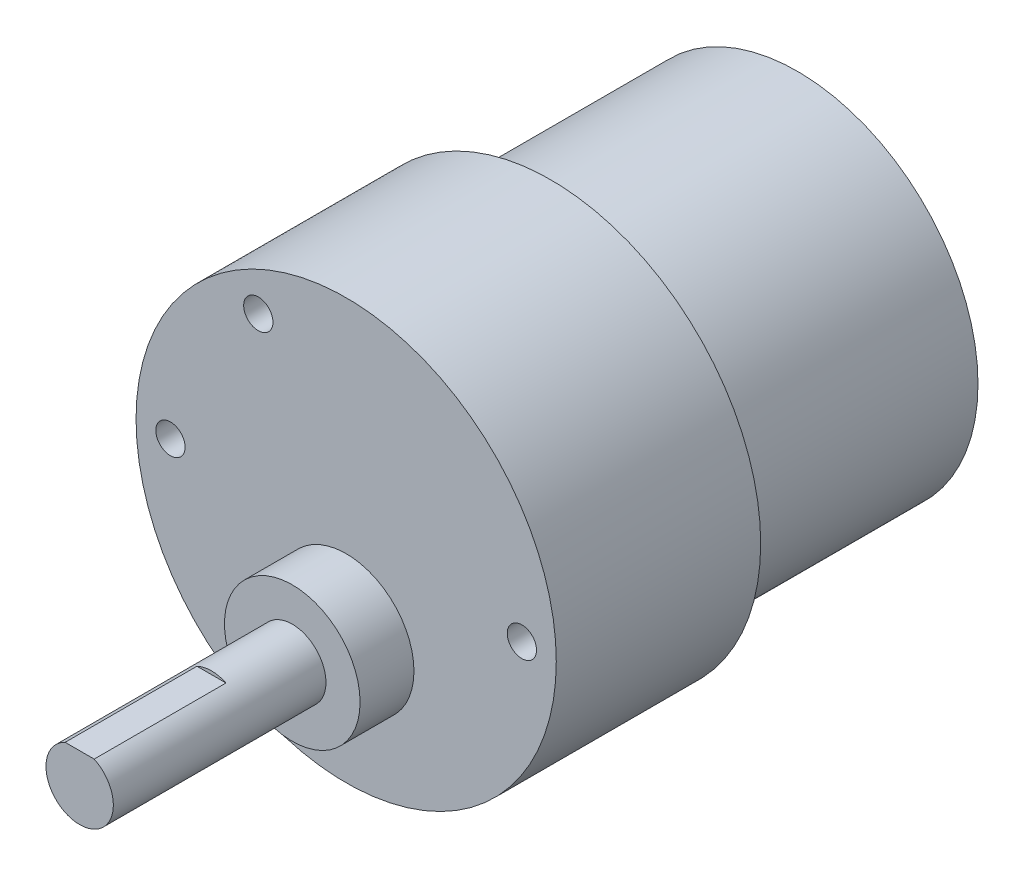
ISO-10303-21;
HEADER;
FILE_DESCRIPTION(('STEP AP214'),'2;1');
FILE_NAME('part.step','',(''),(''),'','','');
FILE_SCHEMA(('AUTOMOTIVE_DESIGN { 1 0 10303 214 1 1 1 1 }'));
ENDSEC;
DATA;
#1=APPLICATION_CONTEXT('core data for automotive mechanical design processes');
#2=APPLICATION_PROTOCOL_DEFINITION('international standard','automotive_design',2000,#1);
#3=PRODUCT_CONTEXT('',#1,'mechanical');
#4=PRODUCT('Part','Part','',(#3));
#5=PRODUCT_RELATED_PRODUCT_CATEGORY('part','',(#4));
#6=PRODUCT_DEFINITION_FORMATION('','',#4);
#7=PRODUCT_DEFINITION_CONTEXT('part definition',#1,'design');
#8=PRODUCT_DEFINITION('design','',#6,#7);
#9=PRODUCT_DEFINITION_SHAPE('','',#8);
#10=(LENGTH_UNIT() NAMED_UNIT(*) SI_UNIT(.MILLI.,.METRE.));
#11=(NAMED_UNIT(*) PLANE_ANGLE_UNIT() SI_UNIT($,.RADIAN.));
#12=(NAMED_UNIT(*) SI_UNIT($,.STERADIAN.) SOLID_ANGLE_UNIT());
#13=UNCERTAINTY_MEASURE_WITH_UNIT(LENGTH_MEASURE(1.E-05),#10,'distance_accuracy_value','');
#14=(GEOMETRIC_REPRESENTATION_CONTEXT(3) GLOBAL_UNCERTAINTY_ASSIGNED_CONTEXT((#13)) GLOBAL_UNIT_ASSIGNED_CONTEXT((#10,
#11,#12)) REPRESENTATION_CONTEXT('',''));
#15=CARTESIAN_POINT('',(0.,0.,0.));
#16=DIRECTION('',(0.,0.,1.));
#17=DIRECTION('',(1.,0.,0.));
#18=AXIS2_PLACEMENT_3D('',#15,#16,#17);
#19=CARTESIAN_POINT('',(0.,0.,0.));
#20=DIRECTION('',(0.,0.,1.));
#21=DIRECTION('',(1.,0.,0.));
#22=AXIS2_PLACEMENT_3D('',#19,#20,#21);
#23=PLANE('',#22);
#24=CARTESIAN_POINT('',(0.,0.,0.));
#25=DIRECTION('',(0.,0.,1.));
#26=DIRECTION('',(1.,0.,0.));
#27=AXIS2_PLACEMENT_3D('',#24,#25,#26);
#28=CIRCLE('',#27,15.6591);
#29=CARTESIAN_POINT('',(15.6591,0.,0.));
#30=VERTEX_POINT('',#29);
#31=EDGE_CURVE('E90',#30,#30,#28,.T.);
#32=ORIENTED_EDGE('',*,*,#31,.F.);
#33=EDGE_LOOP('',(#32));
#34=FACE_BOUND('',#33,.T.);
#35=CARTESIAN_POINT('',(0.,0.,0.));
#36=DIRECTION('',(0.,0.,1.));
#37=DIRECTION('',(1.,0.,0.));
#38=AXIS2_PLACEMENT_3D('',#35,#36,#37);
#39=CIRCLE('',#38,4.4577);
#40=CARTESIAN_POINT('',(4.4577,0.,0.));
#41=VERTEX_POINT('',#40);
#42=EDGE_CURVE('E11',#41,#41,#39,.F.);
#43=ORIENTED_EDGE('',*,*,#42,.F.);
#44=EDGE_LOOP('',(#43));
#45=FACE_BOUND('',#44,.T.);
#46=ADVANCED_FACE('F30',(#34,#45),#23,.F.);
#47=CARTESIAN_POINT('',(0.,-6.8834,43.815));
#48=DIRECTION('',(0.,0.,1.));
#49=DIRECTION('',(1.,0.,0.));
#50=AXIS2_PLACEMENT_3D('',#47,#48,#49);
#51=PLANE('',#50);
#52=CARTESIAN_POINT('',(0.,-6.8834,43.815));
#53=DIRECTION('',(0.,0.,1.));
#54=DIRECTION('',(1.,0.,0.));
#55=AXIS2_PLACEMENT_3D('',#52,#53,#54);
#56=CIRCLE('',#55,5.8801);
#57=CARTESIAN_POINT('',(5.8801,-6.8834,43.815));
#58=VERTEX_POINT('',#57);
#59=EDGE_CURVE('E75',#58,#58,#56,.T.);
#60=ORIENTED_EDGE('',*,*,#59,.T.);
#61=EDGE_LOOP('',(#60));
#62=FACE_BOUND('',#61,.T.);
#63=CARTESIAN_POINT('',(0.,-6.8834,43.815));
#64=DIRECTION('',(0.,0.,1.));
#65=DIRECTION('',(1.,0.,0.));
#66=AXIS2_PLACEMENT_3D('',#63,#64,#65);
#67=CIRCLE('',#66,2.921);
#68=CARTESIAN_POINT('',(2.921,-6.8834,43.815));
#69=VERTEX_POINT('',#68);
#70=EDGE_CURVE('E72',#69,#69,#67,.T.);
#71=ORIENTED_EDGE('',*,*,#70,.F.);
#72=EDGE_LOOP('',(#71));
#73=FACE_BOUND('',#72,.T.);
#74=ADVANCED_FACE('F104',(#62,#73),#51,.T.);
#75=CARTESIAN_POINT('',(0.,0.,39.1414));
#76=DIRECTION('',(0.,0.,1.));
#77=DIRECTION('',(1.,0.,0.));
#78=AXIS2_PLACEMENT_3D('',#75,#76,#77);
#79=PLANE('',#78);
#80=CARTESIAN_POINT('',(-7.61999995005214,13.1982271825123,39.1414));
#81=DIRECTION('',(0.,0.,1.));
#82=DIRECTION('',(1.,0.,0.));
#83=AXIS2_PLACEMENT_3D('',#80,#81,#82);
#84=CIRCLE('',#83,1.27);
#85=CARTESIAN_POINT('',(-6.34999995005214,13.1982271825123,39.1414));
#86=VERTEX_POINT('',#85);
#87=EDGE_CURVE('E273',#86,#86,#84,.T.);
#88=ORIENTED_EDGE('',*,*,#87,.F.);
#89=EDGE_LOOP('',(#88));
#90=FACE_BOUND('',#89,.T.);
#91=CARTESIAN_POINT('',(-7.62000000000006,-13.198227096,39.1414));
#92=DIRECTION('',(0.,0.,1.));
#93=DIRECTION('',(1.,0.,0.));
#94=AXIS2_PLACEMENT_3D('',#91,#92,#93);
#95=CIRCLE('',#94,1.27);
#96=CARTESIAN_POINT('',(-6.35000000000006,-13.198227096,39.1414));
#97=VERTEX_POINT('',#96);
#98=EDGE_CURVE('E279',#97,#97,#95,.T.);
#99=ORIENTED_EDGE('',*,*,#98,.F.);
#100=EDGE_LOOP('',(#99));
#101=FACE_BOUND('',#100,.T.);
#102=CARTESIAN_POINT('',(-15.24,0.,39.1414));
#103=DIRECTION('',(0.,0.,1.));
#104=DIRECTION('',(1.,0.,0.));
#105=AXIS2_PLACEMENT_3D('',#102,#103,#104);
#106=CIRCLE('',#105,1.27);
#107=CARTESIAN_POINT('',(-13.97,0.,39.1414));
#108=VERTEX_POINT('',#107);
#109=EDGE_CURVE('E285',#108,#108,#106,.T.);
#110=ORIENTED_EDGE('',*,*,#109,.F.);
#111=EDGE_LOOP('',(#110));
#112=FACE_BOUND('',#111,.T.);
#113=CARTESIAN_POINT('',(15.24,0.,39.1414));
#114=DIRECTION('',(0.,0.,1.));
#115=DIRECTION('',(1.,0.,0.));
#116=AXIS2_PLACEMENT_3D('',#113,#114,#115);
#117=CIRCLE('',#116,1.27);
#118=CARTESIAN_POINT('',(16.51,0.,39.1414));
#119=VERTEX_POINT('',#118);
#120=EDGE_CURVE('E291',#119,#119,#117,.T.);
#121=ORIENTED_EDGE('',*,*,#120,.F.);
#122=EDGE_LOOP('',(#121));
#123=FACE_BOUND('',#122,.T.);
#124=CARTESIAN_POINT('',(0.,0.,39.1414));
#125=DIRECTION('',(0.,0.,1.));
#126=DIRECTION('',(1.,0.,0.));
#127=AXIS2_PLACEMENT_3D('',#124,#125,#126);
#128=CIRCLE('',#127,18.2245);
#129=CARTESIAN_POINT('',(18.2245,0.,39.1414));
#130=VERTEX_POINT('',#129);
#131=EDGE_CURVE('E87',#130,#130,#128,.T.);
#132=ORIENTED_EDGE('',*,*,#131,.T.);
#133=EDGE_LOOP('',(#132));
#134=FACE_BOUND('',#133,.T.);
#135=CARTESIAN_POINT('',(0.,-6.8834,39.1414));
#136=DIRECTION('',(0.,0.,1.));
#137=DIRECTION('',(1.,0.,0.));
#138=AXIS2_PLACEMENT_3D('',#135,#136,#137);
#139=CIRCLE('',#138,5.8801);
#140=CARTESIAN_POINT('',(5.8801,-6.8834,39.1414));
#141=VERTEX_POINT('',#140);
#142=EDGE_CURVE('E71',#141,#141,#139,.T.);
#143=ORIENTED_EDGE('',*,*,#142,.F.);
#144=EDGE_LOOP('',(#143));
#145=FACE_BOUND('',#144,.T.);
#146=ADVANCED_FACE('F99',(#90,#101,#112,#123,#134,#145),#79,.T.);
#147=CARTESIAN_POINT('',(0.,0.,21.4122));
#148=DIRECTION('',(0.,0.,-1.));
#149=DIRECTION('',(-1.,0.,0.));
#150=AXIS2_PLACEMENT_3D('',#147,#148,#149);
#151=CYLINDRICAL_SURFACE('',#150,15.6591);
#152=CARTESIAN_POINT('',(0.,0.,21.4122));
#153=DIRECTION('',(0.,0.,1.));
#154=DIRECTION('',(1.,0.,0.));
#155=AXIS2_PLACEMENT_3D('',#152,#153,#154);
#156=CIRCLE('',#155,15.6591);
#157=CARTESIAN_POINT('',(15.6591,0.,21.4122));
#158=VERTEX_POINT('',#157);
#159=EDGE_CURVE('E38',#158,#158,#156,.T.);
#160=ORIENTED_EDGE('',*,*,#159,.F.);
#161=EDGE_LOOP('',(#160));
#162=FACE_BOUND('',#161,.T.);
#163=ORIENTED_EDGE('',*,*,#31,.T.);
#164=EDGE_LOOP('',(#163));
#165=FACE_BOUND('',#164,.T.);
#166=ADVANCED_FACE('F32',(#162,#165),#151,.T.);
#167=CARTESIAN_POINT('',(0.,0.,21.4122));
#168=DIRECTION('',(0.,0.,1.));
#169=DIRECTION('',(1.,0.,0.));
#170=AXIS2_PLACEMENT_3D('',#167,#168,#169);
#171=PLANE('',#170);
#172=CARTESIAN_POINT('',(0.,0.,21.4122));
#173=DIRECTION('',(0.,0.,1.));
#174=DIRECTION('',(1.,0.,0.));
#175=AXIS2_PLACEMENT_3D('',#172,#173,#174);
#176=CIRCLE('',#175,18.2245);
#177=CARTESIAN_POINT('',(18.2245,0.,21.4122));
#178=VERTEX_POINT('',#177);
#179=EDGE_CURVE('E84',#178,#178,#176,.T.);
#180=ORIENTED_EDGE('',*,*,#179,.F.);
#181=EDGE_LOOP('',(#180));
#182=FACE_BOUND('',#181,.T.);
#183=ORIENTED_EDGE('',*,*,#159,.T.);
#184=EDGE_LOOP('',(#183));
#185=FACE_BOUND('',#184,.T.);
#186=ADVANCED_FACE('F95',(#182,#185),#171,.F.);
#187=CARTESIAN_POINT('',(0.,0.,39.1414));
#188=DIRECTION('',(0.,0.,-1.));
#189=DIRECTION('',(-1.,0.,0.));
#190=AXIS2_PLACEMENT_3D('',#187,#188,#189);
#191=CYLINDRICAL_SURFACE('',#190,18.2245);
#192=ORIENTED_EDGE('',*,*,#131,.F.);
#193=EDGE_LOOP('',(#192));
#194=FACE_BOUND('',#193,.T.);
#195=ORIENTED_EDGE('',*,*,#179,.T.);
#196=EDGE_LOOP('',(#195));
#197=FACE_BOUND('',#196,.T.);
#198=ADVANCED_FACE('F162',(#194,#197),#191,.T.);
#199=CARTESIAN_POINT('',(0.,-6.8834,43.815));
#200=DIRECTION('',(0.,0.,-1.));
#201=DIRECTION('',(-1.,0.,0.));
#202=AXIS2_PLACEMENT_3D('',#199,#200,#201);
#203=CYLINDRICAL_SURFACE('',#202,5.8801);
#204=ORIENTED_EDGE('',*,*,#59,.F.);
#205=EDGE_LOOP('',(#204));
#206=FACE_BOUND('',#205,.T.);
#207=ORIENTED_EDGE('',*,*,#142,.T.);
#208=EDGE_LOOP('',(#207));
#209=FACE_BOUND('',#208,.T.);
#210=ADVANCED_FACE('F156',(#206,#209),#203,.T.);
#211=CARTESIAN_POINT('',(0.,-6.8834,62.2554));
#212=DIRECTION('',(0.,0.,-1.));
#213=DIRECTION('',(-1.,0.,0.));
#214=AXIS2_PLACEMENT_3D('',#211,#212,#213);
#215=CYLINDRICAL_SURFACE('',#214,2.921);
#216=CARTESIAN_POINT('',(0.,-6.8834,62.2554));
#217=DIRECTION('',(0.,0.,1.));
#218=DIRECTION('',(1.,0.,0.));
#219=AXIS2_PLACEMENT_3D('',#216,#217,#218);
#220=CIRCLE('',#219,2.921);
#221=CARTESIAN_POINT('',(-1.26003906189451,-4.24815,62.2554));
#222=VERTEX_POINT('',#221);
#223=CARTESIAN_POINT('',(1.26003906189451,-4.24815,62.2554));
#224=VERTEX_POINT('',#223);
#225=EDGE_CURVE('E67',#222,#224,#220,.T.);
#226=ORIENTED_EDGE('',*,*,#225,.F.);
#227=DIRECTION('',(0.,0.,1.));
#228=VECTOR('',#227,1.);
#229=CARTESIAN_POINT('',(-1.26003906189451,-4.24815,50.8254));
#230=LINE('',#229,#228);
#231=CARTESIAN_POINT('',(-1.26003906189451,-4.24815,50.8254));
#232=VERTEX_POINT('',#231);
#233=EDGE_CURVE('E45',#232,#222,#230,.T.);
#234=ORIENTED_EDGE('',*,*,#233,.F.);
#235=CARTESIAN_POINT('',(0.,-6.8834,50.8254));
#236=DIRECTION('',(0.,0.,1.));
#237=DIRECTION('',(1.,0.,0.));
#238=AXIS2_PLACEMENT_3D('',#235,#236,#237);
#239=CIRCLE('',#238,2.921);
#240=CARTESIAN_POINT('',(1.26003906189451,-4.24815,50.8254));
#241=VERTEX_POINT('',#240);
#242=EDGE_CURVE('E61',#241,#232,#239,.T.);
#243=ORIENTED_EDGE('',*,*,#242,.F.);
#244=DIRECTION('',(0.,0.,1.));
#245=VECTOR('',#244,1.);
#246=CARTESIAN_POINT('',(1.26003906189451,-4.24815,50.8254));
#247=LINE('',#246,#245);
#248=EDGE_CURVE('E50',#241,#224,#247,.T.);
#249=ORIENTED_EDGE('',*,*,#248,.T.);
#250=EDGE_LOOP('',(#226,#234,#243,#249));
#251=FACE_BOUND('',#250,.T.);
#252=ORIENTED_EDGE('',*,*,#70,.T.);
#253=EDGE_LOOP('',(#252));
#254=FACE_BOUND('',#253,.T.);
#255=ADVANCED_FACE('F65',(#251,#254),#215,.T.);
#256=CARTESIAN_POINT('',(0.,-6.8834,62.2554));
#257=DIRECTION('',(0.,0.,1.));
#258=DIRECTION('',(1.,0.,0.));
#259=AXIS2_PLACEMENT_3D('',#256,#257,#258);
#260=PLANE('',#259);
#261=DIRECTION('',(1.,0.,0.));
#262=VECTOR('',#261,1.);
#263=CARTESIAN_POINT('',(1.26003906189451,-4.24815,62.2554));
#264=LINE('',#263,#262);
#265=EDGE_CURVE('E56',#222,#224,#264,.T.);
#266=ORIENTED_EDGE('',*,*,#265,.F.);
#267=ORIENTED_EDGE('',*,*,#225,.T.);
#268=EDGE_LOOP('',(#266,#267));
#269=FACE_BOUND('',#268,.T.);
#270=ADVANCED_FACE('F70',(#269),#260,.T.);
#271=CARTESIAN_POINT('',(15.24,0.,29.7942));
#272=DIRECTION('',(0.,0.,1.));
#273=DIRECTION('',(1.,0.,0.));
#274=AXIS2_PLACEMENT_3D('',#271,#272,#273);
#275=CYLINDRICAL_SURFACE('',#274,1.27);
#276=CARTESIAN_POINT('',(15.24,0.,29.7942));
#277=DIRECTION('',(0.,0.,1.));
#278=DIRECTION('',(1.,0.,0.));
#279=AXIS2_PLACEMENT_3D('',#276,#277,#278);
#280=CIRCLE('',#279,1.27);
#281=CARTESIAN_POINT('',(16.51,0.,29.7942));
#282=VERTEX_POINT('',#281);
#283=EDGE_CURVE('E78',#282,#282,#280,.T.);
#284=ORIENTED_EDGE('',*,*,#283,.F.);
#285=EDGE_LOOP('',(#284));
#286=FACE_BOUND('',#285,.T.);
#287=ORIENTED_EDGE('',*,*,#120,.T.);
#288=EDGE_LOOP('',(#287));
#289=FACE_BOUND('',#288,.T.);
#290=ADVANCED_FACE('F147',(#286,#289),#275,.F.);
#291=CARTESIAN_POINT('',(15.24,0.,29.7942));
#292=DIRECTION('',(0.,0.,1.));
#293=DIRECTION('',(1.,0.,0.));
#294=AXIS2_PLACEMENT_3D('',#291,#292,#293);
#295=PLANE('',#294);
#296=ORIENTED_EDGE('',*,*,#283,.T.);
#297=EDGE_LOOP('',(#296));
#298=FACE_BOUND('',#297,.T.);
#299=ADVANCED_FACE('F143',(#298),#295,.T.);
#300=CARTESIAN_POINT('',(-15.24,0.,29.7942));
#301=DIRECTION('',(0.,0.,1.));
#302=DIRECTION('',(1.,0.,0.));
#303=AXIS2_PLACEMENT_3D('',#300,#301,#302);
#304=CYLINDRICAL_SURFACE('',#303,1.27);
#305=CARTESIAN_POINT('',(-15.24,0.,29.7942));
#306=DIRECTION('',(0.,0.,1.));
#307=DIRECTION('',(1.,0.,0.));
#308=AXIS2_PLACEMENT_3D('',#305,#306,#307);
#309=CIRCLE('',#308,1.27);
#310=CARTESIAN_POINT('',(-13.97,0.,29.7942));
#311=VERTEX_POINT('',#310);
#312=EDGE_CURVE('E288',#311,#311,#309,.T.);
#313=ORIENTED_EDGE('',*,*,#312,.F.);
#314=EDGE_LOOP('',(#313));
#315=FACE_BOUND('',#314,.T.);
#316=ORIENTED_EDGE('',*,*,#109,.T.);
#317=EDGE_LOOP('',(#316));
#318=FACE_BOUND('',#317,.T.);
#319=ADVANCED_FACE('F139',(#315,#318),#304,.F.);
#320=CARTESIAN_POINT('',(-15.24,0.,29.7942));
#321=DIRECTION('',(0.,0.,1.));
#322=DIRECTION('',(1.,0.,0.));
#323=AXIS2_PLACEMENT_3D('',#320,#321,#322);
#324=PLANE('',#323);
#325=ORIENTED_EDGE('',*,*,#312,.T.);
#326=EDGE_LOOP('',(#325));
#327=FACE_BOUND('',#326,.T.);
#328=ADVANCED_FACE('F135',(#327),#324,.T.);
#329=CARTESIAN_POINT('',(-7.62000000000006,-13.198227096,29.7942));
#330=DIRECTION('',(0.,0.,1.));
#331=DIRECTION('',(1.,0.,0.));
#332=AXIS2_PLACEMENT_3D('',#329,#330,#331);
#333=CYLINDRICAL_SURFACE('',#332,1.27);
#334=CARTESIAN_POINT('',(-7.62000000000006,-13.198227096,29.7942));
#335=DIRECTION('',(0.,0.,1.));
#336=DIRECTION('',(1.,0.,0.));
#337=AXIS2_PLACEMENT_3D('',#334,#335,#336);
#338=CIRCLE('',#337,1.27);
#339=CARTESIAN_POINT('',(-6.35000000000006,-13.198227096,29.7942));
#340=VERTEX_POINT('',#339);
#341=EDGE_CURVE('E282',#340,#340,#338,.T.);
#342=ORIENTED_EDGE('',*,*,#341,.F.);
#343=EDGE_LOOP('',(#342));
#344=FACE_BOUND('',#343,.T.);
#345=ORIENTED_EDGE('',*,*,#98,.T.);
#346=EDGE_LOOP('',(#345));
#347=FACE_BOUND('',#346,.T.);
#348=ADVANCED_FACE('F131',(#344,#347),#333,.F.);
#349=CARTESIAN_POINT('',(-7.62000000000006,-13.198227096,29.7942));
#350=DIRECTION('',(0.,0.,1.));
#351=DIRECTION('',(1.,0.,0.));
#352=AXIS2_PLACEMENT_3D('',#349,#350,#351);
#353=PLANE('',#352);
#354=ORIENTED_EDGE('',*,*,#341,.T.);
#355=EDGE_LOOP('',(#354));
#356=FACE_BOUND('',#355,.T.);
#357=ADVANCED_FACE('F127',(#356),#353,.T.);
#358=CARTESIAN_POINT('',(-7.61999995005214,13.1982271825123,29.7942));
#359=DIRECTION('',(0.,0.,1.));
#360=DIRECTION('',(1.,0.,0.));
#361=AXIS2_PLACEMENT_3D('',#358,#359,#360);
#362=CYLINDRICAL_SURFACE('',#361,1.27);
#363=CARTESIAN_POINT('',(-7.61999995005214,13.1982271825123,29.7942));
#364=DIRECTION('',(0.,0.,1.));
#365=DIRECTION('',(1.,0.,0.));
#366=AXIS2_PLACEMENT_3D('',#363,#364,#365);
#367=CIRCLE('',#366,1.27);
#368=CARTESIAN_POINT('',(-6.34999995005214,13.1982271825123,29.7942));
#369=VERTEX_POINT('',#368);
#370=EDGE_CURVE('E276',#369,#369,#367,.T.);
#371=ORIENTED_EDGE('',*,*,#370,.F.);
#372=EDGE_LOOP('',(#371));
#373=FACE_BOUND('',#372,.T.);
#374=ORIENTED_EDGE('',*,*,#87,.T.);
#375=EDGE_LOOP('',(#374));
#376=FACE_BOUND('',#375,.T.);
#377=ADVANCED_FACE('F119',(#373,#376),#362,.F.);
#378=CARTESIAN_POINT('',(-7.61999995005214,13.1982271825123,29.7942));
#379=DIRECTION('',(0.,0.,1.));
#380=DIRECTION('',(1.,0.,0.));
#381=AXIS2_PLACEMENT_3D('',#378,#379,#380);
#382=PLANE('',#381);
#383=ORIENTED_EDGE('',*,*,#370,.T.);
#384=EDGE_LOOP('',(#383));
#385=FACE_BOUND('',#384,.T.);
#386=ADVANCED_FACE('F110',(#385),#382,.T.);
#387=CARTESIAN_POINT('',(0.,0.,-2.921));
#388=DIRECTION('',(0.,0.,1.));
#389=DIRECTION('',(1.,0.,0.));
#390=AXIS2_PLACEMENT_3D('',#387,#388,#389);
#391=CYLINDRICAL_SURFACE('',#390,4.4577);
#392=CARTESIAN_POINT('',(0.,0.,-2.921));
#393=DIRECTION('',(0.,0.,-1.));
#394=DIRECTION('',(-1.,0.,0.));
#395=AXIS2_PLACEMENT_3D('',#392,#393,#394);
#396=CIRCLE('',#395,4.4577);
#397=CARTESIAN_POINT('',(-4.4577,0.,-2.921));
#398=VERTEX_POINT('',#397);
#399=EDGE_CURVE('E68',#398,#398,#396,.T.);
#400=ORIENTED_EDGE('',*,*,#399,.F.);
#401=EDGE_LOOP('',(#400));
#402=FACE_BOUND('',#401,.T.);
#403=ORIENTED_EDGE('',*,*,#42,.T.);
#404=EDGE_LOOP('',(#403));
#405=FACE_BOUND('',#404,.T.);
#406=ADVANCED_FACE('F107',(#402,#405),#391,.T.);
#407=CARTESIAN_POINT('',(0.,0.,-2.921));
#408=DIRECTION('',(0.,0.,-1.));
#409=DIRECTION('',(-1.,0.,0.));
#410=AXIS2_PLACEMENT_3D('',#407,#408,#409);
#411=PLANE('',#410);
#412=ORIENTED_EDGE('',*,*,#399,.T.);
#413=EDGE_LOOP('',(#412));
#414=FACE_BOUND('',#413,.T.);
#415=ADVANCED_FACE('F109',(#414),#411,.T.);
#416=CARTESIAN_POINT('',(1.26003906189451,-4.24815,50.8254));
#417=DIRECTION('',(0.,-1.,0.));
#418=DIRECTION('',(0.,0.,-1.));
#419=AXIS2_PLACEMENT_3D('',#416,#417,#418);
#420=PLANE('',#419);
#421=ORIENTED_EDGE('',*,*,#265,.T.);
#422=ORIENTED_EDGE('',*,*,#248,.F.);
#423=DIRECTION('',(1.,0.,0.));
#424=VECTOR('',#423,1.);
#425=CARTESIAN_POINT('',(1.26003906189451,-4.24815,50.8254));
#426=LINE('',#425,#424);
#427=EDGE_CURVE('E266',#232,#241,#426,.T.);
#428=ORIENTED_EDGE('',*,*,#427,.F.);
#429=ORIENTED_EDGE('',*,*,#233,.T.);
#430=EDGE_LOOP('',(#421,#422,#428,#429));
#431=FACE_BOUND('',#430,.T.);
#432=ADVANCED_FACE('F57',(#431),#420,.F.);
#433=CARTESIAN_POINT('',(0.,-6.8834,50.8254));
#434=DIRECTION('',(0.,0.,1.));
#435=DIRECTION('',(1.,0.,0.));
#436=AXIS2_PLACEMENT_3D('',#433,#434,#435);
#437=PLANE('',#436);
#438=ORIENTED_EDGE('',*,*,#242,.T.);
#439=ORIENTED_EDGE('',*,*,#427,.T.);
#440=EDGE_LOOP('',(#438,#439));
#441=FACE_BOUND('',#440,.T.);
#442=ADVANCED_FACE('F254',(#441),#437,.T.);
#443=CLOSED_SHELL('',(#46,#74,#146,#166,#186,#198,#210,#255,#270,#290,#299,#319,#328,#348,#357,
#377,#386,#406,#415,#432,#442));
#444=MANIFOLD_SOLID_BREP('B2',#443);
#445=ADVANCED_BREP_SHAPE_REPRESENTATION('',(#18,#444),#14);
#446=SHAPE_DEFINITION_REPRESENTATION(#9,#445);
ENDSEC;
END-ISO-10303-21;
